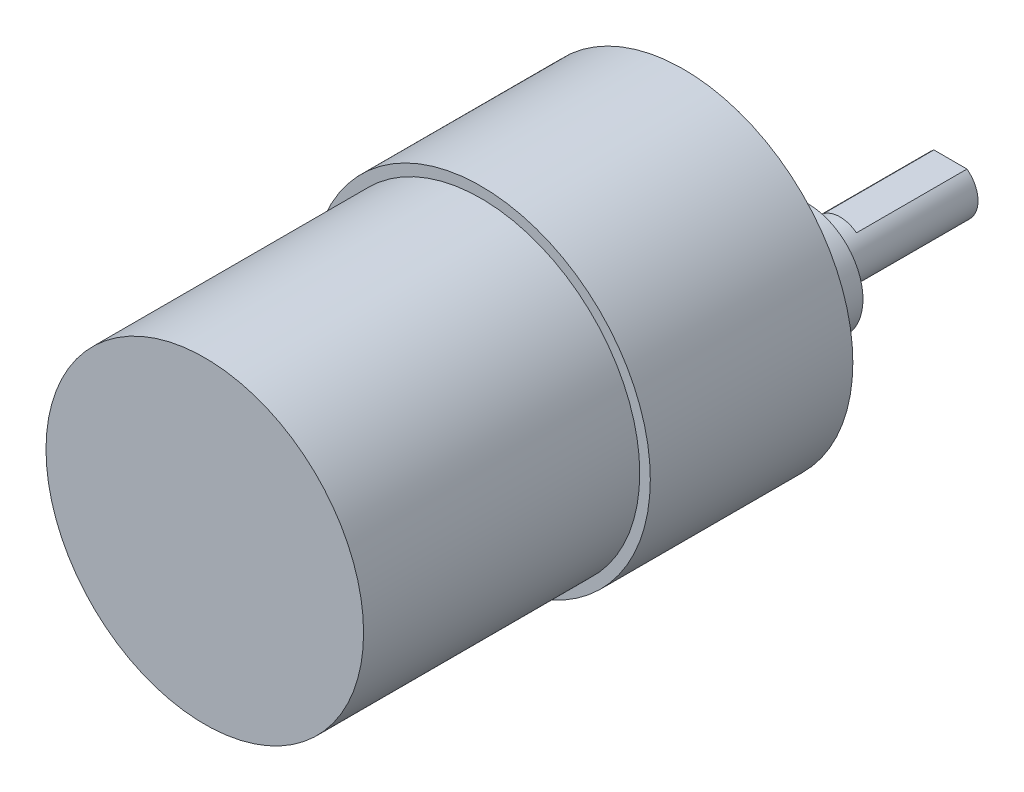
ISO-10303-21;
HEADER;
FILE_DESCRIPTION(('STEP AP214'),'2;1');
FILE_NAME('part.step','',(''),(''),'','','');
FILE_SCHEMA(('AUTOMOTIVE_DESIGN { 1 0 10303 214 1 1 1 1 }'));
ENDSEC;
DATA;
#1=APPLICATION_CONTEXT('core data for automotive mechanical design processes');
#2=APPLICATION_PROTOCOL_DEFINITION('international standard','automotive_design',2000,#1);
#3=PRODUCT_CONTEXT('',#1,'mechanical');
#4=PRODUCT('Part','Part','',(#3));
#5=PRODUCT_RELATED_PRODUCT_CATEGORY('part','',(#4));
#6=PRODUCT_DEFINITION_FORMATION('','',#4);
#7=PRODUCT_DEFINITION_CONTEXT('part definition',#1,'design');
#8=PRODUCT_DEFINITION('design','',#6,#7);
#9=PRODUCT_DEFINITION_SHAPE('','',#8);
#10=(LENGTH_UNIT() NAMED_UNIT(*) SI_UNIT(.MILLI.,.METRE.));
#11=(NAMED_UNIT(*) PLANE_ANGLE_UNIT() SI_UNIT($,.RADIAN.));
#12=(NAMED_UNIT(*) SI_UNIT($,.STERADIAN.) SOLID_ANGLE_UNIT());
#13=UNCERTAINTY_MEASURE_WITH_UNIT(LENGTH_MEASURE(1.E-05),#10,'distance_accuracy_value','');
#14=(GEOMETRIC_REPRESENTATION_CONTEXT(3) GLOBAL_UNCERTAINTY_ASSIGNED_CONTEXT((#13)) GLOBAL_UNIT_ASSIGNED_CONTEXT((#10,
#11,#12)) REPRESENTATION_CONTEXT('',''));
#15=CARTESIAN_POINT('',(0.,0.,0.));
#16=DIRECTION('',(0.,0.,1.));
#17=DIRECTION('',(1.,0.,0.));
#18=AXIS2_PLACEMENT_3D('',#15,#16,#17);
#19=CARTESIAN_POINT('',(0.,0.,-22.));
#20=DIRECTION('',(0.,0.,-1.));
#21=DIRECTION('',(1.,0.,0.));
#22=AXIS2_PLACEMENT_3D('',#19,#20,#21);
#23=PLANE('',#22);
#24=CARTESIAN_POINT('',(-13.4233937586588,7.75,-22.));
#25=DIRECTION('',(0.,0.,1.));
#26=DIRECTION('',(1.,0.,0.));
#27=AXIS2_PLACEMENT_3D('',#24,#25,#26);
#28=CIRCLE('',#27,1.25);
#29=CARTESIAN_POINT('',(-12.1733937586588,7.75,-22.));
#30=VERTEX_POINT('',#29);
#31=EDGE_CURVE('E106',#30,#30,#28,.T.);
#32=ORIENTED_EDGE('',*,*,#31,.T.);
#33=EDGE_LOOP('',(#32));
#34=FACE_BOUND('',#33,.T.);
#35=CARTESIAN_POINT('',(0.,15.5,-22.));
#36=DIRECTION('',(0.,0.,1.));
#37=DIRECTION('',(1.,0.,0.));
#38=AXIS2_PLACEMENT_3D('',#35,#36,#37);
#39=CIRCLE('',#38,1.25);
#40=CARTESIAN_POINT('',(1.25,15.5,-22.));
#41=VERTEX_POINT('',#40);
#42=EDGE_CURVE('E112',#41,#41,#39,.T.);
#43=ORIENTED_EDGE('',*,*,#42,.T.);
#44=EDGE_LOOP('',(#43));
#45=FACE_BOUND('',#44,.T.);
#46=CARTESIAN_POINT('',(13.4233937586588,7.75,-22.));
#47=DIRECTION('',(0.,0.,1.));
#48=DIRECTION('',(1.,0.,0.));
#49=AXIS2_PLACEMENT_3D('',#46,#47,#48);
#50=CIRCLE('',#49,1.25);
#51=CARTESIAN_POINT('',(14.6733937586588,7.75,-22.));
#52=VERTEX_POINT('',#51);
#53=EDGE_CURVE('E118',#52,#52,#50,.T.);
#54=ORIENTED_EDGE('',*,*,#53,.T.);
#55=EDGE_LOOP('',(#54));
#56=FACE_BOUND('',#55,.T.);
#57=CARTESIAN_POINT('',(13.4233937586588,-7.75000000000001,-22.));
#58=DIRECTION('',(0.,0.,1.));
#59=DIRECTION('',(1.,0.,0.));
#60=AXIS2_PLACEMENT_3D('',#57,#58,#59);
#61=CIRCLE('',#60,1.25);
#62=CARTESIAN_POINT('',(14.6733937586588,-7.75000000000001,-22.));
#63=VERTEX_POINT('',#62);
#64=EDGE_CURVE('E124',#63,#63,#61,.T.);
#65=ORIENTED_EDGE('',*,*,#64,.T.);
#66=EDGE_LOOP('',(#65));
#67=FACE_BOUND('',#66,.T.);
#68=CARTESIAN_POINT('',(0.,-15.5,-22.));
#69=DIRECTION('',(0.,0.,1.));
#70=DIRECTION('',(1.,0.,0.));
#71=AXIS2_PLACEMENT_3D('',#68,#69,#70);
#72=CIRCLE('',#71,1.25);
#73=CARTESIAN_POINT('',(1.25,-15.5,-22.));
#74=VERTEX_POINT('',#73);
#75=EDGE_CURVE('E130',#74,#74,#72,.T.);
#76=ORIENTED_EDGE('',*,*,#75,.T.);
#77=EDGE_LOOP('',(#76));
#78=FACE_BOUND('',#77,.T.);
#79=CARTESIAN_POINT('',(-13.4233937586588,-7.75,-22.));
#80=DIRECTION('',(0.,0.,1.));
#81=DIRECTION('',(1.,0.,0.));
#82=AXIS2_PLACEMENT_3D('',#79,#80,#81);
#83=CIRCLE('',#82,1.25);
#84=CARTESIAN_POINT('',(-12.1733937586588,-7.75,-22.));
#85=VERTEX_POINT('',#84);
#86=EDGE_CURVE('E136',#85,#85,#83,.T.);
#87=ORIENTED_EDGE('',*,*,#86,.T.);
#88=EDGE_LOOP('',(#87));
#89=FACE_BOUND('',#88,.T.);
#90=CARTESIAN_POINT('',(0.,0.,-22.));
#91=DIRECTION('',(0.,0.,1.));
#92=DIRECTION('',(1.,0.,0.));
#93=AXIS2_PLACEMENT_3D('',#90,#91,#92);
#94=CIRCLE('',#93,18.4);
#95=CARTESIAN_POINT('',(18.4,0.,-22.));
#96=VERTEX_POINT('',#95);
#97=EDGE_CURVE('E43',#96,#96,#94,.T.);
#98=ORIENTED_EDGE('',*,*,#97,.F.);
#99=EDGE_LOOP('',(#98));
#100=FACE_BOUND('',#99,.T.);
#101=CARTESIAN_POINT('',(7.,0.,-22.));
#102=DIRECTION('',(0.,0.,1.));
#103=DIRECTION('',(1.,0.,0.));
#104=AXIS2_PLACEMENT_3D('',#101,#102,#103);
#105=CIRCLE('',#104,6.);
#106=CARTESIAN_POINT('',(0.999999999999996,0.,-22.));
#107=VERTEX_POINT('',#106);
#108=EDGE_CURVE('E98',#107,#107,#105,.T.);
#109=ORIENTED_EDGE('',*,*,#108,.T.);
#110=EDGE_LOOP('',(#109));
#111=FACE_BOUND('',#110,.T.);
#112=ADVANCED_FACE('F34',(#34,#45,#56,#67,#78,#89,#100,#111),#23,.T.);
#113=CARTESIAN_POINT('',(0.,0.,0.));
#114=DIRECTION('',(0.,0.,-1.));
#115=DIRECTION('',(1.,0.,0.));
#116=AXIS2_PLACEMENT_3D('',#113,#114,#115);
#117=PLANE('',#116);
#118=CARTESIAN_POINT('',(0.,0.,0.));
#119=DIRECTION('',(0.,0.,1.));
#120=DIRECTION('',(1.,0.,0.));
#121=AXIS2_PLACEMENT_3D('',#118,#119,#120);
#122=CIRCLE('',#121,18.4);
#123=CARTESIAN_POINT('',(18.4,0.,0.));
#124=VERTEX_POINT('',#123);
#125=EDGE_CURVE('E142',#124,#124,#122,.T.);
#126=ORIENTED_EDGE('',*,*,#125,.T.);
#127=EDGE_LOOP('',(#126));
#128=FACE_BOUND('',#127,.T.);
#129=CARTESIAN_POINT('',(0.,0.,0.));
#130=DIRECTION('',(0.,0.,1.));
#131=DIRECTION('',(1.,0.,0.));
#132=AXIS2_PLACEMENT_3D('',#129,#130,#131);
#133=CIRCLE('',#132,17.25);
#134=CARTESIAN_POINT('',(17.25,0.,0.));
#135=VERTEX_POINT('',#134);
#136=EDGE_CURVE('E11',#135,#135,#133,.F.);
#137=ORIENTED_EDGE('',*,*,#136,.T.);
#138=EDGE_LOOP('',(#137));
#139=FACE_BOUND('',#138,.T.);
#140=ADVANCED_FACE('F148',(#128,#139),#117,.F.);
#141=CARTESIAN_POINT('',(0.,0.,-22.));
#142=DIRECTION('',(0.,0.,1.));
#143=DIRECTION('',(-1.,0.,0.));
#144=AXIS2_PLACEMENT_3D('',#141,#142,#143);
#145=CYLINDRICAL_SURFACE('',#144,18.4);
#146=ORIENTED_EDGE('',*,*,#97,.T.);
#147=EDGE_LOOP('',(#146));
#148=FACE_BOUND('',#147,.T.);
#149=ORIENTED_EDGE('',*,*,#125,.F.);
#150=EDGE_LOOP('',(#149));
#151=FACE_BOUND('',#150,.T.);
#152=ADVANCED_FACE('F36',(#148,#151),#145,.T.);
#153=CARTESIAN_POINT('',(-13.4233937586588,-7.75,-14.38));
#154=DIRECTION('',(0.,0.,-1.));
#155=DIRECTION('',(1.,0.,0.));
#156=AXIS2_PLACEMENT_3D('',#153,#154,#155);
#157=CONICAL_SURFACE('',#156,1.25,1.02974425867665);
#158=CARTESIAN_POINT('',(-13.4233937586588,-7.75,-13.6289242262155));
#159=VERTEX_POINT('',#158);
#160=VERTEX_LOOP('',#159);
#161=FACE_BOUND('',#160,.T.);
#162=CARTESIAN_POINT('',(-13.4233937586588,-7.75,-14.38));
#163=DIRECTION('',(0.,0.,1.));
#164=DIRECTION('',(1.,0.,0.));
#165=AXIS2_PLACEMENT_3D('',#162,#163,#164);
#166=CIRCLE('',#165,1.25);
#167=CARTESIAN_POINT('',(-12.1733937586588,-7.75,-14.38));
#168=VERTEX_POINT('',#167);
#169=EDGE_CURVE('E139',#168,#168,#166,.T.);
#170=ORIENTED_EDGE('',*,*,#169,.F.);
#171=EDGE_LOOP('',(#170));
#172=FACE_BOUND('',#171,.T.);
#173=ADVANCED_FACE('F152',(#161,#172),#157,.F.);
#174=CARTESIAN_POINT('',(-13.4233937586588,-7.75,-22.));
#175=DIRECTION('',(0.,0.,-1.));
#176=DIRECTION('',(1.,0.,0.));
#177=AXIS2_PLACEMENT_3D('',#174,#175,#176);
#178=CYLINDRICAL_SURFACE('',#177,1.25);
#179=ORIENTED_EDGE('',*,*,#169,.T.);
#180=EDGE_LOOP('',(#179));
#181=FACE_BOUND('',#180,.T.);
#182=ORIENTED_EDGE('',*,*,#86,.F.);
#183=EDGE_LOOP('',(#182));
#184=FACE_BOUND('',#183,.T.);
#185=ADVANCED_FACE('F158',(#181,#184),#178,.F.);
#186=CARTESIAN_POINT('',(0.,-15.5,-14.38));
#187=DIRECTION('',(0.,0.,-1.));
#188=DIRECTION('',(1.,0.,0.));
#189=AXIS2_PLACEMENT_3D('',#186,#187,#188);
#190=CONICAL_SURFACE('',#189,1.25,1.02974425867665);
#191=CARTESIAN_POINT('',(0.,-15.5,-13.6289242262155));
#192=VERTEX_POINT('',#191);
#193=VERTEX_LOOP('',#192);
#194=FACE_BOUND('',#193,.T.);
#195=CARTESIAN_POINT('',(0.,-15.5,-14.38));
#196=DIRECTION('',(0.,0.,1.));
#197=DIRECTION('',(1.,0.,0.));
#198=AXIS2_PLACEMENT_3D('',#195,#196,#197);
#199=CIRCLE('',#198,1.25);
#200=CARTESIAN_POINT('',(1.25,-15.5,-14.38));
#201=VERTEX_POINT('',#200);
#202=EDGE_CURVE('E133',#201,#201,#199,.T.);
#203=ORIENTED_EDGE('',*,*,#202,.F.);
#204=EDGE_LOOP('',(#203));
#205=FACE_BOUND('',#204,.T.);
#206=ADVANCED_FACE('F169',(#194,#205),#190,.F.);
#207=CARTESIAN_POINT('',(0.,-15.5,-22.));
#208=DIRECTION('',(0.,0.,-1.));
#209=DIRECTION('',(1.,0.,0.));
#210=AXIS2_PLACEMENT_3D('',#207,#208,#209);
#211=CYLINDRICAL_SURFACE('',#210,1.25);
#212=ORIENTED_EDGE('',*,*,#202,.T.);
#213=EDGE_LOOP('',(#212));
#214=FACE_BOUND('',#213,.T.);
#215=ORIENTED_EDGE('',*,*,#75,.F.);
#216=EDGE_LOOP('',(#215));
#217=FACE_BOUND('',#216,.T.);
#218=ADVANCED_FACE('F173',(#214,#217),#211,.F.);
#219=CARTESIAN_POINT('',(13.4233937586588,-7.75000000000001,-14.38));
#220=DIRECTION('',(0.,0.,-1.));
#221=DIRECTION('',(1.,0.,0.));
#222=AXIS2_PLACEMENT_3D('',#219,#220,#221);
#223=CONICAL_SURFACE('',#222,1.25,1.02974425867665);
#224=CARTESIAN_POINT('',(13.4233937586588,-7.75000000000001,-13.6289242262155));
#225=VERTEX_POINT('',#224);
#226=VERTEX_LOOP('',#225);
#227=FACE_BOUND('',#226,.T.);
#228=CARTESIAN_POINT('',(13.4233937586588,-7.75000000000001,-14.38));
#229=DIRECTION('',(0.,0.,1.));
#230=DIRECTION('',(1.,0.,0.));
#231=AXIS2_PLACEMENT_3D('',#228,#229,#230);
#232=CIRCLE('',#231,1.25);
#233=CARTESIAN_POINT('',(14.6733937586588,-7.75000000000001,-14.38));
#234=VERTEX_POINT('',#233);
#235=EDGE_CURVE('E127',#234,#234,#232,.T.);
#236=ORIENTED_EDGE('',*,*,#235,.F.);
#237=EDGE_LOOP('',(#236));
#238=FACE_BOUND('',#237,.T.);
#239=ADVANCED_FACE('F177',(#227,#238),#223,.F.);
#240=CARTESIAN_POINT('',(13.4233937586588,-7.75000000000001,-22.));
#241=DIRECTION('',(0.,0.,-1.));
#242=DIRECTION('',(1.,0.,0.));
#243=AXIS2_PLACEMENT_3D('',#240,#241,#242);
#244=CYLINDRICAL_SURFACE('',#243,1.25);
#245=ORIENTED_EDGE('',*,*,#235,.T.);
#246=EDGE_LOOP('',(#245));
#247=FACE_BOUND('',#246,.T.);
#248=ORIENTED_EDGE('',*,*,#64,.F.);
#249=EDGE_LOOP('',(#248));
#250=FACE_BOUND('',#249,.T.);
#251=ADVANCED_FACE('F181',(#247,#250),#244,.F.);
#252=CARTESIAN_POINT('',(13.4233937586588,7.75,-14.38));
#253=DIRECTION('',(0.,0.,-1.));
#254=DIRECTION('',(1.,0.,0.));
#255=AXIS2_PLACEMENT_3D('',#252,#253,#254);
#256=CONICAL_SURFACE('',#255,1.25,1.02974425867665);
#257=CARTESIAN_POINT('',(13.4233937586588,7.75,-13.6289242262155));
#258=VERTEX_POINT('',#257);
#259=VERTEX_LOOP('',#258);
#260=FACE_BOUND('',#259,.T.);
#261=CARTESIAN_POINT('',(13.4233937586588,7.75,-14.38));
#262=DIRECTION('',(0.,0.,1.));
#263=DIRECTION('',(1.,0.,0.));
#264=AXIS2_PLACEMENT_3D('',#261,#262,#263);
#265=CIRCLE('',#264,1.25);
#266=CARTESIAN_POINT('',(14.6733937586588,7.75,-14.38));
#267=VERTEX_POINT('',#266);
#268=EDGE_CURVE('E121',#267,#267,#265,.T.);
#269=ORIENTED_EDGE('',*,*,#268,.F.);
#270=EDGE_LOOP('',(#269));
#271=FACE_BOUND('',#270,.T.);
#272=ADVANCED_FACE('F185',(#260,#271),#256,.F.);
#273=CARTESIAN_POINT('',(13.4233937586588,7.75,-22.));
#274=DIRECTION('',(0.,0.,-1.));
#275=DIRECTION('',(1.,0.,0.));
#276=AXIS2_PLACEMENT_3D('',#273,#274,#275);
#277=CYLINDRICAL_SURFACE('',#276,1.25);
#278=ORIENTED_EDGE('',*,*,#268,.T.);
#279=EDGE_LOOP('',(#278));
#280=FACE_BOUND('',#279,.T.);
#281=ORIENTED_EDGE('',*,*,#53,.F.);
#282=EDGE_LOOP('',(#281));
#283=FACE_BOUND('',#282,.T.);
#284=ADVANCED_FACE('F189',(#280,#283),#277,.F.);
#285=CARTESIAN_POINT('',(0.,15.5,-14.38));
#286=DIRECTION('',(0.,0.,-1.));
#287=DIRECTION('',(1.,0.,0.));
#288=AXIS2_PLACEMENT_3D('',#285,#286,#287);
#289=CONICAL_SURFACE('',#288,1.25,1.02974425867665);
#290=CARTESIAN_POINT('',(0.,15.5,-13.6289242262155));
#291=VERTEX_POINT('',#290);
#292=VERTEX_LOOP('',#291);
#293=FACE_BOUND('',#292,.T.);
#294=CARTESIAN_POINT('',(0.,15.5,-14.38));
#295=DIRECTION('',(0.,0.,1.));
#296=DIRECTION('',(1.,0.,0.));
#297=AXIS2_PLACEMENT_3D('',#294,#295,#296);
#298=CIRCLE('',#297,1.25);
#299=CARTESIAN_POINT('',(1.24999999999999,15.5,-14.38));
#300=VERTEX_POINT('',#299);
#301=EDGE_CURVE('E115',#300,#300,#298,.T.);
#302=ORIENTED_EDGE('',*,*,#301,.F.);
#303=EDGE_LOOP('',(#302));
#304=FACE_BOUND('',#303,.T.);
#305=ADVANCED_FACE('F193',(#293,#304),#289,.F.);
#306=CARTESIAN_POINT('',(0.,15.5,-22.));
#307=DIRECTION('',(0.,0.,-1.));
#308=DIRECTION('',(1.,0.,0.));
#309=AXIS2_PLACEMENT_3D('',#306,#307,#308);
#310=CYLINDRICAL_SURFACE('',#309,1.25);
#311=ORIENTED_EDGE('',*,*,#301,.T.);
#312=EDGE_LOOP('',(#311));
#313=FACE_BOUND('',#312,.T.);
#314=ORIENTED_EDGE('',*,*,#42,.F.);
#315=EDGE_LOOP('',(#314));
#316=FACE_BOUND('',#315,.T.);
#317=ADVANCED_FACE('F197',(#313,#316),#310,.F.);
#318=CARTESIAN_POINT('',(-13.4233937586588,7.75,-14.38));
#319=DIRECTION('',(0.,0.,-1.));
#320=DIRECTION('',(1.,0.,0.));
#321=AXIS2_PLACEMENT_3D('',#318,#319,#320);
#322=CONICAL_SURFACE('',#321,1.25,1.02974425867665);
#323=CARTESIAN_POINT('',(-13.4233937586588,7.75,-13.6289242262155));
#324=VERTEX_POINT('',#323);
#325=VERTEX_LOOP('',#324);
#326=FACE_BOUND('',#325,.T.);
#327=CARTESIAN_POINT('',(-13.4233937586588,7.75,-14.38));
#328=DIRECTION('',(0.,0.,1.));
#329=DIRECTION('',(1.,0.,0.));
#330=AXIS2_PLACEMENT_3D('',#327,#328,#329);
#331=CIRCLE('',#330,1.25);
#332=CARTESIAN_POINT('',(-12.1733937586588,7.75,-14.38));
#333=VERTEX_POINT('',#332);
#334=EDGE_CURVE('E109',#333,#333,#331,.T.);
#335=ORIENTED_EDGE('',*,*,#334,.F.);
#336=EDGE_LOOP('',(#335));
#337=FACE_BOUND('',#336,.T.);
#338=ADVANCED_FACE('F201',(#326,#337),#322,.F.);
#339=CARTESIAN_POINT('',(-13.4233937586588,7.75,-22.));
#340=DIRECTION('',(0.,0.,-1.));
#341=DIRECTION('',(1.,0.,0.));
#342=AXIS2_PLACEMENT_3D('',#339,#340,#341);
#343=CYLINDRICAL_SURFACE('',#342,1.25);
#344=ORIENTED_EDGE('',*,*,#334,.T.);
#345=EDGE_LOOP('',(#344));
#346=FACE_BOUND('',#345,.T.);
#347=ORIENTED_EDGE('',*,*,#31,.F.);
#348=EDGE_LOOP('',(#347));
#349=FACE_BOUND('',#348,.T.);
#350=ADVANCED_FACE('F205',(#346,#349),#343,.F.);
#351=CARTESIAN_POINT('',(0.,0.,30.));
#352=DIRECTION('',(0.,0.,-1.));
#353=DIRECTION('',(1.,0.,0.));
#354=AXIS2_PLACEMENT_3D('',#351,#352,#353);
#355=CYLINDRICAL_SURFACE('',#354,17.25);
#356=CARTESIAN_POINT('',(0.,0.,30.));
#357=DIRECTION('',(0.,0.,-1.));
#358=DIRECTION('',(-1.,0.,0.));
#359=AXIS2_PLACEMENT_3D('',#356,#357,#358);
#360=CIRCLE('',#359,17.25);
#361=CARTESIAN_POINT('',(-17.25,0.,30.));
#362=VERTEX_POINT('',#361);
#363=EDGE_CURVE('E103',#362,#362,#360,.T.);
#364=ORIENTED_EDGE('',*,*,#363,.T.);
#365=EDGE_LOOP('',(#364));
#366=FACE_BOUND('',#365,.T.);
#367=ORIENTED_EDGE('',*,*,#136,.F.);
#368=EDGE_LOOP('',(#367));
#369=FACE_BOUND('',#368,.T.);
#370=ADVANCED_FACE('F209',(#366,#369),#355,.T.);
#371=CARTESIAN_POINT('',(0.,0.,30.));
#372=DIRECTION('',(0.,0.,1.));
#373=DIRECTION('',(-1.,0.,0.));
#374=AXIS2_PLACEMENT_3D('',#371,#372,#373);
#375=PLANE('',#374);
#376=ORIENTED_EDGE('',*,*,#363,.F.);
#377=EDGE_LOOP('',(#376));
#378=FACE_BOUND('',#377,.T.);
#379=ADVANCED_FACE('F213',(#378),#375,.T.);
#380=CARTESIAN_POINT('',(7.,0.,-28.5));
#381=DIRECTION('',(0.,0.,-1.));
#382=DIRECTION('',(1.,0.,0.));
#383=AXIS2_PLACEMENT_3D('',#380,#381,#382);
#384=PLANE('',#383);
#385=CARTESIAN_POINT('',(7.,0.,-28.5));
#386=DIRECTION('',(0.,0.,1.));
#387=DIRECTION('',(1.,0.,0.));
#388=AXIS2_PLACEMENT_3D('',#385,#386,#387);
#389=CIRCLE('',#388,6.);
#390=CARTESIAN_POINT('',(0.999999999999996,0.,-28.5));
#391=VERTEX_POINT('',#390);
#392=EDGE_CURVE('E240',#391,#391,#389,.T.);
#393=ORIENTED_EDGE('',*,*,#392,.F.);
#394=EDGE_LOOP('',(#393));
#395=FACE_BOUND('',#394,.T.);
#396=CARTESIAN_POINT('',(7.,0.,-28.5));
#397=DIRECTION('',(0.,0.,1.));
#398=DIRECTION('',(1.,0.,0.));
#399=AXIS2_PLACEMENT_3D('',#396,#397,#398);
#400=CIRCLE('',#399,3.);
#401=CARTESIAN_POINT('',(10.,0.,-28.5));
#402=VERTEX_POINT('',#401);
#403=EDGE_CURVE('E38',#402,#402,#400,.T.);
#404=ORIENTED_EDGE('',*,*,#403,.T.);
#405=EDGE_LOOP('',(#404));
#406=FACE_BOUND('',#405,.T.);
#407=ADVANCED_FACE('F217',(#395,#406),#384,.T.);
#408=CARTESIAN_POINT('',(7.,0.,-28.5));
#409=DIRECTION('',(0.,0.,1.));
#410=DIRECTION('',(-1.,0.,0.));
#411=AXIS2_PLACEMENT_3D('',#408,#409,#410);
#412=CYLINDRICAL_SURFACE('',#411,6.);
#413=CARTESIAN_POINT('',(0.999999999999996,0.,-28.5));
#414=CARTESIAN_POINT('',(0.999999999999996,0.,-28.4322916666667));
#415=CARTESIAN_POINT('',(0.999999999999996,0.,-28.3645833333333));
#416=CARTESIAN_POINT('',(0.999999999999996,0.,-28.2291666666667));
#417=CARTESIAN_POINT('',(0.999999999999996,0.,-28.1614583333333));
#418=CARTESIAN_POINT('',(0.999999999999996,0.,-28.0260416666667));
#419=CARTESIAN_POINT('',(0.999999999999996,0.,-27.9583333333333));
#420=CARTESIAN_POINT('',(0.999999999999996,0.,-27.8229166666667));
#421=CARTESIAN_POINT('',(0.999999999999996,0.,-27.7552083333333));
#422=CARTESIAN_POINT('',(0.999999999999996,0.,-27.6197916666667));
#423=CARTESIAN_POINT('',(0.999999999999996,0.,-27.5520833333333));
#424=CARTESIAN_POINT('',(0.999999999999996,0.,-27.4166666666667));
#425=CARTESIAN_POINT('',(0.999999999999996,0.,-27.3489583333333));
#426=CARTESIAN_POINT('',(0.999999999999996,0.,-27.2135416666667));
#427=CARTESIAN_POINT('',(0.999999999999996,0.,-27.1458333333333));
#428=CARTESIAN_POINT('',(0.999999999999996,0.,-27.0104166666667));
#429=CARTESIAN_POINT('',(0.999999999999996,0.,-26.9427083333333));
#430=CARTESIAN_POINT('',(0.999999999999996,0.,-26.8072916666667));
#431=CARTESIAN_POINT('',(0.999999999999996,0.,-26.7395833333333));
#432=CARTESIAN_POINT('',(0.999999999999996,0.,-26.6041666666667));
#433=CARTESIAN_POINT('',(0.999999999999996,0.,-26.5364583333333));
#434=CARTESIAN_POINT('',(0.999999999999996,0.,-26.4010416666667));
#435=CARTESIAN_POINT('',(0.999999999999996,0.,-26.3333333333333));
#436=CARTESIAN_POINT('',(0.999999999999996,0.,-26.1979166666667));
#437=CARTESIAN_POINT('',(0.999999999999996,0.,-26.1302083333333));
#438=CARTESIAN_POINT('',(0.999999999999996,0.,-25.9947916666667));
#439=CARTESIAN_POINT('',(0.999999999999996,0.,-25.9270833333333));
#440=CARTESIAN_POINT('',(0.999999999999996,0.,-25.7916666666667));
#441=CARTESIAN_POINT('',(0.999999999999996,0.,-25.7239583333333));
#442=CARTESIAN_POINT('',(0.999999999999996,0.,-25.5885416666667));
#443=CARTESIAN_POINT('',(0.999999999999996,0.,-25.5208333333333));
#444=CARTESIAN_POINT('',(0.999999999999996,0.,-25.3854166666667));
#445=CARTESIAN_POINT('',(0.999999999999996,0.,-25.3177083333333));
#446=CARTESIAN_POINT('',(0.999999999999996,0.,-25.1822916666667));
#447=CARTESIAN_POINT('',(0.999999999999996,0.,-25.1145833333333));
#448=CARTESIAN_POINT('',(0.999999999999996,0.,-24.9791666666667));
#449=CARTESIAN_POINT('',(0.999999999999996,0.,-24.9114583333333));
#450=CARTESIAN_POINT('',(0.999999999999996,0.,-24.7760416666667));
#451=CARTESIAN_POINT('',(0.999999999999996,0.,-24.7083333333333));
#452=CARTESIAN_POINT('',(0.999999999999996,0.,-24.5729166666667));
#453=CARTESIAN_POINT('',(0.999999999999996,0.,-24.5052083333333));
#454=CARTESIAN_POINT('',(0.999999999999996,0.,-24.3697916666667));
#455=CARTESIAN_POINT('',(0.999999999999996,0.,-24.3020833333333));
#456=CARTESIAN_POINT('',(0.999999999999996,0.,-24.1666666666667));
#457=CARTESIAN_POINT('',(0.999999999999996,0.,-24.0989583333333));
#458=CARTESIAN_POINT('',(0.999999999999996,0.,-23.9635416666667));
#459=CARTESIAN_POINT('',(0.999999999999996,0.,-23.8958333333333));
#460=CARTESIAN_POINT('',(0.999999999999996,0.,-23.7604166666667));
#461=CARTESIAN_POINT('',(0.999999999999996,0.,-23.6927083333333));
#462=CARTESIAN_POINT('',(0.999999999999996,0.,-23.5572916666667));
#463=CARTESIAN_POINT('',(0.999999999999996,0.,-23.4895833333333));
#464=CARTESIAN_POINT('',(0.999999999999996,0.,-23.3541666666667));
#465=CARTESIAN_POINT('',(0.999999999999996,0.,-23.2864583333333));
#466=CARTESIAN_POINT('',(0.999999999999996,0.,-23.1510416666667));
#467=CARTESIAN_POINT('',(0.999999999999996,0.,-23.0833333333333));
#468=CARTESIAN_POINT('',(0.999999999999996,0.,-22.9479166666667));
#469=CARTESIAN_POINT('',(0.999999999999996,0.,-22.8802083333333));
#470=CARTESIAN_POINT('',(0.999999999999996,0.,-22.7447916666667));
#471=CARTESIAN_POINT('',(0.999999999999996,0.,-22.6770833333333));
#472=CARTESIAN_POINT('',(0.999999999999996,0.,-22.5416666666667));
#473=CARTESIAN_POINT('',(0.999999999999996,0.,-22.4739583333333));
#474=CARTESIAN_POINT('',(0.999999999999996,0.,-22.3385416666667));
#475=CARTESIAN_POINT('',(0.999999999999996,0.,-22.2708333333333));
#476=CARTESIAN_POINT('',(0.999999999999996,0.,-22.1354166666667));
#477=CARTESIAN_POINT('',(0.999999999999996,0.,-22.0677083333333));
#478=CARTESIAN_POINT('',(0.999999999999996,0.,-22.));
#479=B_SPLINE_CURVE_WITH_KNOTS('',3,(#413,#414,#415,#416,#417,#418,#419,#420,#421,#422,#423,
#424,#425,#426,#427,#428,#429,#430,#431,#432,#433,#434,#435,#436,#437,#438,#439,#440,#441,#442,
#443,#444,#445,#446,#447,#448,#449,#450,#451,#452,#453,#454,#455,#456,#457,#458,#459,#460,#461,
#462,#463,#464,#465,#466,#467,#468,#469,#470,#471,#472,#473,#474,#475,#476,#477,#478),
.UNSPECIFIED.,.F.,.F.,(4,2,2,2,2,2,2,2,2,2,2,2,2,2,2,2,2,2,2,2,2,2,2,2,2,2,2,2,2,2,2,2,4),(0.,
0.203124999999998,0.406249999999997,0.609374999999999,0.812499999999997,1.015625,1.21875,
1.421875,1.625,1.828125,2.03125,2.234375,2.4375,2.640625,2.84375,3.046875,3.25,3.453125,3.65625,
3.859375,4.0625,4.26562499999999,4.46875,4.671875,4.875,5.078125,5.28125,5.484375,5.6875,
5.890625,6.09374999999999,6.296875,6.5),.UNSPECIFIED.);
#480=EDGE_CURVE('BSEAM229',#391,#107,#479,.T.);
#481=ORIENTED_EDGE('',*,*,#392,.T.);
#482=ORIENTED_EDGE('',*,*,#108,.F.);
#483=ORIENTED_EDGE('',*,*,#480,.T.);
#484=ORIENTED_EDGE('',*,*,#480,.F.);
#485=EDGE_LOOP('',(#481,#483,#482,#484));
#486=FACE_BOUND('',#485,.T.);
#487=ADVANCED_FACE('F229',(#486),#412,.T.);
#488=CARTESIAN_POINT('',(7.,0.,-32.));
#489=DIRECTION('',(0.,0.,-1.));
#490=DIRECTION('',(1.,0.,0.));
#491=AXIS2_PLACEMENT_3D('',#488,#489,#490);
#492=PLANE('',#491);
#493=CARTESIAN_POINT('',(7.,0.,-32.));
#494=DIRECTION('',(0.,0.,1.));
#495=DIRECTION('',(1.,0.,0.));
#496=AXIS2_PLACEMENT_3D('',#493,#494,#495);
#497=CIRCLE('',#496,3.);
#498=CARTESIAN_POINT('',(8.8,2.4,-32.));
#499=VERTEX_POINT('',#498);
#500=CARTESIAN_POINT('',(5.20000000000001,2.4,-32.));
#501=VERTEX_POINT('',#500);
#502=EDGE_CURVE('E92',#499,#501,#497,.T.);
#503=ORIENTED_EDGE('',*,*,#502,.F.);
#504=DIRECTION('',(1.,0.,0.));
#505=VECTOR('',#504,1.);
#506=CARTESIAN_POINT('',(5.20000000000001,2.4,-32.));
#507=LINE('',#506,#505);
#508=EDGE_CURVE('E83',#501,#499,#507,.T.);
#509=ORIENTED_EDGE('',*,*,#508,.F.);
#510=EDGE_LOOP('',(#503,#509));
#511=FACE_BOUND('',#510,.T.);
#512=ADVANCED_FACE('F91',(#511),#492,.T.);
#513=CARTESIAN_POINT('',(5.20000000000001,2.4,-32.));
#514=DIRECTION('',(0.,-1.,0.));
#515=DIRECTION('',(0.,0.,1.));
#516=AXIS2_PLACEMENT_3D('',#513,#514,#515);
#517=PLANE('',#516);
#518=DIRECTION('',(1.,0.,0.));
#519=VECTOR('',#518,1.);
#520=CARTESIAN_POINT('',(5.20000000000001,2.4,-44.));
#521=LINE('',#520,#519);
#522=CARTESIAN_POINT('',(5.2,2.4,-44.));
#523=VERTEX_POINT('',#522);
#524=CARTESIAN_POINT('',(8.8,2.4,-44.));
#525=VERTEX_POINT('',#524);
#526=EDGE_CURVE('E85',#523,#525,#521,.T.);
#527=ORIENTED_EDGE('',*,*,#526,.F.);
#528=DIRECTION('',(0.,0.,-1.));
#529=VECTOR('',#528,1.);
#530=CARTESIAN_POINT('',(5.20000000000001,2.4,-32.));
#531=LINE('',#530,#529);
#532=EDGE_CURVE('E79',#501,#523,#531,.T.);
#533=ORIENTED_EDGE('',*,*,#532,.F.);
#534=ORIENTED_EDGE('',*,*,#508,.T.);
#535=DIRECTION('',(0.,0.,-1.));
#536=VECTOR('',#535,1.);
#537=CARTESIAN_POINT('',(8.8,2.4,-32.));
#538=LINE('',#537,#536);
#539=EDGE_CURVE('E88',#499,#525,#538,.T.);
#540=ORIENTED_EDGE('',*,*,#539,.T.);
#541=EDGE_LOOP('',(#527,#533,#534,#540));
#542=FACE_BOUND('',#541,.T.);
#543=ADVANCED_FACE('F81',(#542),#517,.F.);
#544=CARTESIAN_POINT('',(7.,0.,-44.));
#545=DIRECTION('',(0.,0.,-1.));
#546=DIRECTION('',(1.,0.,0.));
#547=AXIS2_PLACEMENT_3D('',#544,#545,#546);
#548=PLANE('',#547);
#549=ORIENTED_EDGE('',*,*,#526,.T.);
#550=CARTESIAN_POINT('',(7.,0.,-44.));
#551=DIRECTION('',(0.,0.,1.));
#552=DIRECTION('',(1.,0.,0.));
#553=AXIS2_PLACEMENT_3D('',#550,#551,#552);
#554=CIRCLE('',#553,3.);
#555=EDGE_CURVE('E49',#523,#525,#554,.T.);
#556=ORIENTED_EDGE('',*,*,#555,.F.);
#557=EDGE_LOOP('',(#549,#556));
#558=FACE_BOUND('',#557,.T.);
#559=ADVANCED_FACE('F221',(#558),#548,.T.);
#560=CARTESIAN_POINT('',(7.,0.,-44.));
#561=DIRECTION('',(0.,0.,1.));
#562=DIRECTION('',(-1.,0.,0.));
#563=AXIS2_PLACEMENT_3D('',#560,#561,#562);
#564=CYLINDRICAL_SURFACE('',#563,3.);
#565=ORIENTED_EDGE('',*,*,#403,.F.);
#566=EDGE_LOOP('',(#565));
#567=FACE_BOUND('',#566,.T.);
#568=ORIENTED_EDGE('',*,*,#555,.T.);
#569=ORIENTED_EDGE('',*,*,#539,.F.);
#570=ORIENTED_EDGE('',*,*,#502,.T.);
#571=ORIENTED_EDGE('',*,*,#532,.T.);
#572=EDGE_LOOP('',(#568,#569,#570,#571));
#573=FACE_BOUND('',#572,.T.);
#574=ADVANCED_FACE('F94',(#567,#573),#564,.T.);
#575=CLOSED_SHELL('',(#112,#140,#152,#173,#185,#206,#218,#239,#251,#272,#284,#305,#317,#338,
#350,#370,#379,#407,#487,#512,#543,#559,#574));
#576=MANIFOLD_SOLID_BREP('B2',#575);
#577=ADVANCED_BREP_SHAPE_REPRESENTATION('',(#18,#576),#14);
#578=SHAPE_DEFINITION_REPRESENTATION(#9,#577);
ENDSEC;
END-ISO-10303-21;
